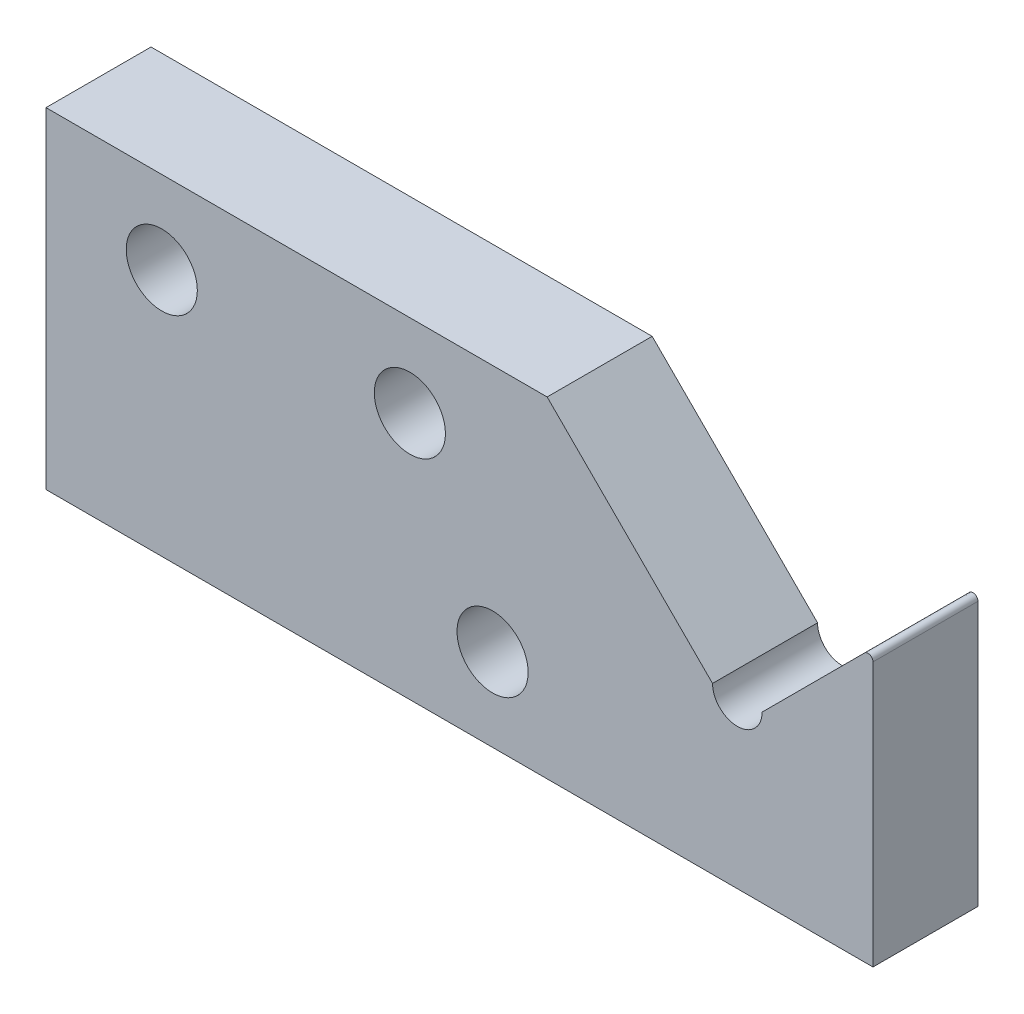
ISO-10303-21;
HEADER;
FILE_DESCRIPTION(('STEP AP214'),'2;1');
FILE_NAME('part.step','',(''),(''),'','','');
FILE_SCHEMA(('AUTOMOTIVE_DESIGN { 1 0 10303 214 1 1 1 1 }'));
ENDSEC;
DATA;
#1=APPLICATION_CONTEXT('core data for automotive mechanical design processes');
#2=APPLICATION_PROTOCOL_DEFINITION('international standard','automotive_design',2000,#1);
#3=PRODUCT_CONTEXT('',#1,'mechanical');
#4=PRODUCT('Part','Part','',(#3));
#5=PRODUCT_RELATED_PRODUCT_CATEGORY('part','',(#4));
#6=PRODUCT_DEFINITION_FORMATION('','',#4);
#7=PRODUCT_DEFINITION_CONTEXT('part definition',#1,'design');
#8=PRODUCT_DEFINITION('design','',#6,#7);
#9=PRODUCT_DEFINITION_SHAPE('','',#8);
#10=(LENGTH_UNIT() NAMED_UNIT(*) SI_UNIT(.MILLI.,.METRE.));
#11=(NAMED_UNIT(*) PLANE_ANGLE_UNIT() SI_UNIT($,.RADIAN.));
#12=(NAMED_UNIT(*) SI_UNIT($,.STERADIAN.) SOLID_ANGLE_UNIT());
#13=UNCERTAINTY_MEASURE_WITH_UNIT(LENGTH_MEASURE(1.E-05),#10,'distance_accuracy_value','');
#14=(GEOMETRIC_REPRESENTATION_CONTEXT(3) GLOBAL_UNCERTAINTY_ASSIGNED_CONTEXT((#13)) GLOBAL_UNIT_ASSIGNED_CONTEXT((#10,
#11,#12)) REPRESENTATION_CONTEXT('',''));
#15=CARTESIAN_POINT('',(0.,0.,0.));
#16=DIRECTION('',(0.,0.,1.));
#17=DIRECTION('',(1.,0.,0.));
#18=AXIS2_PLACEMENT_3D('',#15,#16,#17);
#19=CARTESIAN_POINT('',(-9.50000000000004,164.78629150102,-3.175));
#20=DIRECTION('',(1.,0.,0.));
#21=DIRECTION('',(0.,0.,-1.));
#22=AXIS2_PLACEMENT_3D('',#19,#20,#21);
#23=PLANE('',#22);
#24=DIRECTION('',(0.,1.,0.));
#25=VECTOR('',#24,1.);
#26=CARTESIAN_POINT('',(-9.50000000000004,164.78629150102,-3.175));
#27=LINE('',#26,#25);
#28=CARTESIAN_POINT('',(-9.50000000000004,164.78629150102,-3.175));
#29=VERTEX_POINT('',#28);
#30=CARTESIAN_POINT('',(-9.50000000000004,180.762027432302,-3.175));
#31=VERTEX_POINT('',#30);
#32=EDGE_CURVE('E138',#29,#31,#27,.T.);
#33=ORIENTED_EDGE('',*,*,#32,.T.);
#34=DIRECTION('',(0.,0.,1.));
#35=VECTOR('',#34,1.);
#36=CARTESIAN_POINT('',(-9.50000000000004,180.762027432302,-3.175));
#37=LINE('',#36,#35);
#38=CARTESIAN_POINT('',(-9.50000000000004,180.762027432302,3.175));
#39=VERTEX_POINT('',#38);
#40=EDGE_CURVE('E157',#31,#39,#37,.T.);
#41=ORIENTED_EDGE('',*,*,#40,.T.);
#42=DIRECTION('',(0.,1.,0.));
#43=VECTOR('',#42,1.);
#44=CARTESIAN_POINT('',(-9.50000000000004,164.78629150102,3.175));
#45=LINE('',#44,#43);
#46=CARTESIAN_POINT('',(-9.50000000000004,164.78629150102,3.175));
#47=VERTEX_POINT('',#46);
#48=EDGE_CURVE('E102',#47,#39,#45,.T.);
#49=ORIENTED_EDGE('',*,*,#48,.F.);
#50=DIRECTION('',(0.,0.,1.));
#51=VECTOR('',#50,1.);
#52=CARTESIAN_POINT('',(-9.50000000000004,164.78629150102,-3.175));
#53=LINE('',#52,#51);
#54=EDGE_CURVE('E155',#29,#47,#53,.T.);
#55=ORIENTED_EDGE('',*,*,#54,.F.);
#56=EDGE_LOOP('',(#33,#41,#49,#55));
#57=FACE_BOUND('',#56,.T.);
#58=ADVANCED_FACE('F33',(#57),#23,.T.);
#59=CARTESIAN_POINT('',(-9.50000000000004,164.78629150102,-3.175));
#60=DIRECTION('',(0.,-1.,0.));
#61=DIRECTION('',(1.,0.,0.));
#62=AXIS2_PLACEMENT_3D('',#59,#60,#61);
#63=PLANE('',#62);
#64=ORIENTED_EDGE('',*,*,#54,.T.);
#65=DIRECTION('',(1.,0.,0.));
#66=VECTOR('',#65,1.);
#67=CARTESIAN_POINT('',(-9.50000000000004,164.78629150102,3.175));
#68=LINE('',#67,#66);
#69=CARTESIAN_POINT('',(-59.5,164.786291501016,3.175));
#70=VERTEX_POINT('',#69);
#71=EDGE_CURVE('E126',#70,#47,#68,.T.);
#72=ORIENTED_EDGE('',*,*,#71,.F.);
#73=DIRECTION('',(0.,0.,1.));
#74=VECTOR('',#73,1.);
#75=CARTESIAN_POINT('',(-59.5,164.786291501016,-3.175));
#76=LINE('',#75,#74);
#77=CARTESIAN_POINT('',(-59.5,164.786291501016,-3.175));
#78=VERTEX_POINT('',#77);
#79=EDGE_CURVE('E158',#78,#70,#76,.T.);
#80=ORIENTED_EDGE('',*,*,#79,.F.);
#81=DIRECTION('',(1.,0.,0.));
#82=VECTOR('',#81,1.);
#83=CARTESIAN_POINT('',(-9.50000000000004,164.78629150102,-3.175));
#84=LINE('',#83,#82);
#85=EDGE_CURVE('E112',#78,#29,#84,.T.);
#86=ORIENTED_EDGE('',*,*,#85,.T.);
#87=EDGE_LOOP('',(#64,#72,#80,#86));
#88=FACE_BOUND('',#87,.T.);
#89=ADVANCED_FACE('F211',(#88),#63,.T.);
#90=CARTESIAN_POINT('',(-59.5,184.786291501016,-3.175));
#91=DIRECTION('',(-1.,0.,0.));
#92=DIRECTION('',(0.,0.,1.));
#93=AXIS2_PLACEMENT_3D('',#90,#91,#92);
#94=PLANE('',#93);
#95=CARTESIAN_POINT('',(-59.5,169.786291501016,0.));
#96=DIRECTION('',(-1.,0.,0.));
#97=DIRECTION('',(0.,0.,1.));
#98=AXIS2_PLACEMENT_3D('',#95,#96,#97);
#99=CIRCLE('',#98,1.6);
#100=CARTESIAN_POINT('',(-59.5,169.786291501016,1.6));
#101=VERTEX_POINT('',#100);
#102=EDGE_CURVE('E191',#101,#101,#99,.T.);
#103=ORIENTED_EDGE('',*,*,#102,.F.);
#104=EDGE_LOOP('',(#103));
#105=FACE_BOUND('',#104,.T.);
#106=ORIENTED_EDGE('',*,*,#79,.T.);
#107=DIRECTION('',(0.,-1.,0.));
#108=VECTOR('',#107,1.);
#109=CARTESIAN_POINT('',(-59.5,184.786291501016,3.175));
#110=LINE('',#109,#108);
#111=CARTESIAN_POINT('',(-59.5,184.786291501016,3.175));
#112=VERTEX_POINT('',#111);
#113=EDGE_CURVE('E123',#112,#70,#110,.T.);
#114=ORIENTED_EDGE('',*,*,#113,.F.);
#115=DIRECTION('',(0.,0.,1.));
#116=VECTOR('',#115,1.);
#117=CARTESIAN_POINT('',(-59.5,184.786291501016,-3.175));
#118=LINE('',#117,#116);
#119=CARTESIAN_POINT('',(-59.5,184.786291501016,-3.175));
#120=VERTEX_POINT('',#119);
#121=EDGE_CURVE('E160',#120,#112,#118,.T.);
#122=ORIENTED_EDGE('',*,*,#121,.F.);
#123=DIRECTION('',(0.,-1.,0.));
#124=VECTOR('',#123,1.);
#125=CARTESIAN_POINT('',(-59.5,184.786291501016,-3.175));
#126=LINE('',#125,#124);
#127=EDGE_CURVE('E150',#120,#78,#126,.T.);
#128=ORIENTED_EDGE('',*,*,#127,.T.);
#129=EDGE_LOOP('',(#106,#114,#122,#128));
#130=FACE_BOUND('',#129,.T.);
#131=ADVANCED_FACE('F207',(#105,#130),#94,.T.);
#132=CARTESIAN_POINT('',(-29.1999999999943,184.78629150102,-3.175));
#133=DIRECTION('',(-1.20915378919549E-13,1.,0.));
#134=DIRECTION('',(-1.,-1.20915378919549E-13,0.));
#135=AXIS2_PLACEMENT_3D('',#132,#133,#134);
#136=PLANE('',#135);
#137=ORIENTED_EDGE('',*,*,#121,.T.);
#138=DIRECTION('',(-1.,-1.20915378919549E-13,0.));
#139=VECTOR('',#138,1.);
#140=CARTESIAN_POINT('',(-29.1999999999943,184.78629150102,3.175));
#141=LINE('',#140,#139);
#142=CARTESIAN_POINT('',(-29.1999999999943,184.78629150102,3.175));
#143=VERTEX_POINT('',#142);
#144=EDGE_CURVE('E117',#143,#112,#141,.T.);
#145=ORIENTED_EDGE('',*,*,#144,.F.);
#146=DIRECTION('',(0.,0.,1.));
#147=VECTOR('',#146,1.);
#148=CARTESIAN_POINT('',(-29.1999999999943,184.78629150102,-3.175));
#149=LINE('',#148,#147);
#150=CARTESIAN_POINT('',(-29.1999999999943,184.78629150102,-3.175));
#151=VERTEX_POINT('',#150);
#152=EDGE_CURVE('E162',#151,#143,#149,.T.);
#153=ORIENTED_EDGE('',*,*,#152,.F.);
#154=DIRECTION('',(-1.,-1.20915378919549E-13,0.));
#155=VECTOR('',#154,1.);
#156=CARTESIAN_POINT('',(-29.1999999999943,184.78629150102,-3.175));
#157=LINE('',#156,#155);
#158=EDGE_CURVE('E147',#151,#120,#157,.T.);
#159=ORIENTED_EDGE('',*,*,#158,.T.);
#160=EDGE_LOOP('',(#137,#145,#153,#159));
#161=FACE_BOUND('',#160,.T.);
#162=ADVANCED_FACE('F210',(#161),#136,.T.);
#163=CARTESIAN_POINT('',(-19.1999999999969,174.786291501019,-3.175));
#164=DIRECTION('',(0.707106781186657,0.707106781186438,0.));
#165=DIRECTION('',(-0.707106781186438,0.707106781186657,0.));
#166=AXIS2_PLACEMENT_3D('',#163,#164,#165);
#167=PLANE('',#166);
#168=ORIENTED_EDGE('',*,*,#152,.T.);
#169=DIRECTION('',(-0.707106781186438,0.707106781186657,0.));
#170=VECTOR('',#169,1.);
#171=CARTESIAN_POINT('',(-19.1999999999969,174.786291501019,3.175));
#172=LINE('',#171,#170);
#173=CARTESIAN_POINT('',(-19.1999999999969,174.786291501019,3.175));
#174=VERTEX_POINT('',#173);
#175=EDGE_CURVE('E115',#174,#143,#172,.T.);
#176=ORIENTED_EDGE('',*,*,#175,.F.);
#177=DIRECTION('',(0.,0.,1.));
#178=VECTOR('',#177,1.);
#179=CARTESIAN_POINT('',(-19.1999999999969,174.786291501019,-3.175));
#180=LINE('',#179,#178);
#181=CARTESIAN_POINT('',(-19.1999999999969,174.786291501019,-3.175));
#182=VERTEX_POINT('',#181);
#183=EDGE_CURVE('E111',#182,#174,#180,.T.);
#184=ORIENTED_EDGE('',*,*,#183,.F.);
#185=DIRECTION('',(-0.707106781186438,0.707106781186657,0.));
#186=VECTOR('',#185,1.);
#187=CARTESIAN_POINT('',(-19.1999999999969,174.786291501019,-3.175));
#188=LINE('',#187,#186);
#189=EDGE_CURVE('E144',#182,#151,#188,.T.);
#190=ORIENTED_EDGE('',*,*,#189,.T.);
#191=EDGE_LOOP('',(#168,#176,#184,#190));
#192=FACE_BOUND('',#191,.T.);
#193=ADVANCED_FACE('F238',(#192),#167,.T.);
#194=CARTESIAN_POINT('',(-17.6999999999969,174.786291501019,-3.175));
#195=DIRECTION('',(0.,0.,1.));
#196=DIRECTION('',(1.,0.,0.));
#197=AXIS2_PLACEMENT_3D('',#194,#195,#196);
#198=CYLINDRICAL_SURFACE('',#197,1.5);
#199=ORIENTED_EDGE('',*,*,#183,.T.);
#200=CARTESIAN_POINT('',(-17.6999999999969,174.786291501019,3.175));
#201=DIRECTION('',(0.,0.,-1.));
#202=DIRECTION('',(1.,0.,0.));
#203=AXIS2_PLACEMENT_3D('',#200,#201,#202);
#204=CIRCLE('',#203,1.5);
#205=CARTESIAN_POINT('',(-16.1999999999969,174.786291501019,3.175));
#206=VERTEX_POINT('',#205);
#207=EDGE_CURVE('E100',#206,#174,#204,.T.);
#208=ORIENTED_EDGE('',*,*,#207,.F.);
#209=DIRECTION('',(0.,0.,1.));
#210=VECTOR('',#209,1.);
#211=CARTESIAN_POINT('',(-16.1999999999969,174.786291501019,-3.175));
#212=LINE('',#211,#210);
#213=CARTESIAN_POINT('',(-16.1999999999969,174.786291501019,-3.175));
#214=VERTEX_POINT('',#213);
#215=EDGE_CURVE('E105',#214,#206,#212,.T.);
#216=ORIENTED_EDGE('',*,*,#215,.F.);
#217=CARTESIAN_POINT('',(-17.6999999999969,174.786291501019,-3.175));
#218=DIRECTION('',(0.,0.,-1.));
#219=DIRECTION('',(1.,0.,0.));
#220=AXIS2_PLACEMENT_3D('',#217,#218,#219);
#221=CIRCLE('',#220,1.5);
#222=EDGE_CURVE('E142',#214,#182,#221,.T.);
#223=ORIENTED_EDGE('',*,*,#222,.T.);
#224=EDGE_LOOP('',(#199,#208,#216,#223));
#225=FACE_BOUND('',#224,.T.);
#226=ADVANCED_FACE('F114',(#225),#198,.F.);
#227=CARTESIAN_POINT('',(-9.50000000000004,181.486291501014,-3.175));
#228=DIRECTION('',(-0.707106781186438,0.707106781186657,0.));
#229=DIRECTION('',(-0.707106781186657,-0.707106781186438,0.));
#230=AXIS2_PLACEMENT_3D('',#227,#228,#229);
#231=PLANE('',#230);
#232=DIRECTION('',(-0.707106781186657,-0.707106781186438,0.));
#233=VECTOR('',#232,1.);
#234=CARTESIAN_POINT('',(-9.50000000000004,181.486291501014,3.175));
#235=LINE('',#234,#233);
#236=CARTESIAN_POINT('',(-10.012132034356,180.974159466658,3.175));
#237=VERTEX_POINT('',#236);
#238=EDGE_CURVE('E94',#237,#206,#235,.T.);
#239=ORIENTED_EDGE('',*,*,#238,.F.);
#240=DIRECTION('',(0.,0.,1.));
#241=VECTOR('',#240,1.);
#242=CARTESIAN_POINT('',(-10.012132034356,180.974159466658,-3.175));
#243=LINE('',#242,#241);
#244=CARTESIAN_POINT('',(-10.012132034356,180.974159466658,-3.175));
#245=VERTEX_POINT('',#244);
#246=EDGE_CURVE('E41',#237,#245,#243,.F.);
#247=ORIENTED_EDGE('',*,*,#246,.T.);
#248=DIRECTION('',(-0.707106781186657,-0.707106781186438,0.));
#249=VECTOR('',#248,1.);
#250=CARTESIAN_POINT('',(-9.50000000000004,181.486291501014,-3.175));
#251=LINE('',#250,#249);
#252=EDGE_CURVE('E107',#245,#214,#251,.T.);
#253=ORIENTED_EDGE('',*,*,#252,.T.);
#254=ORIENTED_EDGE('',*,*,#215,.T.);
#255=EDGE_LOOP('',(#239,#247,#253,#254));
#256=FACE_BOUND('',#255,.T.);
#257=ADVANCED_FACE('F106',(#256),#231,.T.);
#258=CARTESIAN_POINT('',(-17.6999999999969,174.786291501019,-3.175));
#259=DIRECTION('',(0.,0.,1.));
#260=DIRECTION('',(1.,0.,0.));
#261=AXIS2_PLACEMENT_3D('',#258,#259,#260);
#262=PLANE('',#261);
#263=CARTESIAN_POINT('',(-32.5,169.786291501016,-3.175));
#264=DIRECTION('',(0.,0.,1.));
#265=DIRECTION('',(1.,0.,0.));
#266=AXIS2_PLACEMENT_3D('',#263,#264,#265);
#267=CIRCLE('',#266,2.15000000000002);
#268=CARTESIAN_POINT('',(-30.35,169.786291501016,-3.175));
#269=VERTEX_POINT('',#268);
#270=EDGE_CURVE('E129',#269,#269,#267,.T.);
#271=ORIENTED_EDGE('',*,*,#270,.T.);
#272=EDGE_LOOP('',(#271));
#273=FACE_BOUND('',#272,.T.);
#274=CARTESIAN_POINT('',(-37.5,179.786291501017,-3.175));
#275=DIRECTION('',(0.,0.,1.));
#276=DIRECTION('',(1.,0.,0.));
#277=AXIS2_PLACEMENT_3D('',#274,#275,#276);
#278=CIRCLE('',#277,2.14999999999987);
#279=CARTESIAN_POINT('',(-35.3500000000002,179.786291501017,-3.175));
#280=VERTEX_POINT('',#279);
#281=EDGE_CURVE('E132',#280,#280,#278,.T.);
#282=ORIENTED_EDGE('',*,*,#281,.T.);
#283=EDGE_LOOP('',(#282));
#284=FACE_BOUND('',#283,.T.);
#285=CARTESIAN_POINT('',(-52.5,179.786291501016,-3.175));
#286=DIRECTION('',(0.,0.,1.));
#287=DIRECTION('',(1.,0.,0.));
#288=AXIS2_PLACEMENT_3D('',#285,#286,#287);
#289=CIRCLE('',#288,2.15000000000003);
#290=CARTESIAN_POINT('',(-50.35,179.786291501016,-3.175));
#291=VERTEX_POINT('',#290);
#292=EDGE_CURVE('E135',#291,#291,#289,.T.);
#293=ORIENTED_EDGE('',*,*,#292,.T.);
#294=EDGE_LOOP('',(#293));
#295=FACE_BOUND('',#294,.T.);
#296=ORIENTED_EDGE('',*,*,#252,.F.);
#297=CARTESIAN_POINT('',(-9.80000000000004,180.762027432302,-3.175));
#298=DIRECTION('',(0.,0.,1.));
#299=DIRECTION('',(1.,0.,0.));
#300=AXIS2_PLACEMENT_3D('',#297,#298,#299);
#301=CIRCLE('',#300,0.3);
#302=EDGE_CURVE('E12',#245,#31,#301,.F.);
#303=ORIENTED_EDGE('',*,*,#302,.T.);
#304=ORIENTED_EDGE('',*,*,#32,.F.);
#305=ORIENTED_EDGE('',*,*,#85,.F.);
#306=ORIENTED_EDGE('',*,*,#127,.F.);
#307=ORIENTED_EDGE('',*,*,#158,.F.);
#308=ORIENTED_EDGE('',*,*,#189,.F.);
#309=ORIENTED_EDGE('',*,*,#222,.F.);
#310=EDGE_LOOP('',(#296,#303,#304,#305,#306,#307,#308,#309));
#311=FACE_BOUND('',#310,.T.);
#312=ADVANCED_FACE('F219',(#273,#284,#295,#311),#262,.F.);
#313=CARTESIAN_POINT('',(-52.5,179.786291501016,-3.175));
#314=DIRECTION('',(0.,0.,1.));
#315=DIRECTION('',(1.,0.,0.));
#316=AXIS2_PLACEMENT_3D('',#313,#314,#315);
#317=CYLINDRICAL_SURFACE('',#316,2.15000000000003);
#318=ORIENTED_EDGE('',*,*,#292,.F.);
#319=EDGE_LOOP('',(#318));
#320=FACE_BOUND('',#319,.T.);
#321=CARTESIAN_POINT('',(-52.5,179.786291501016,3.175));
#322=DIRECTION('',(0.,0.,1.));
#323=DIRECTION('',(1.,0.,0.));
#324=AXIS2_PLACEMENT_3D('',#321,#322,#323);
#325=CIRCLE('',#324,2.15000000000003);
#326=CARTESIAN_POINT('',(-50.35,179.786291501016,3.175));
#327=VERTEX_POINT('',#326);
#328=EDGE_CURVE('E179',#327,#327,#325,.T.);
#329=ORIENTED_EDGE('',*,*,#328,.T.);
#330=EDGE_LOOP('',(#329));
#331=FACE_BOUND('',#330,.T.);
#332=ADVANCED_FACE('F247',(#320,#331),#317,.F.);
#333=CARTESIAN_POINT('',(-37.5,179.786291501017,-3.175));
#334=DIRECTION('',(0.,0.,1.));
#335=DIRECTION('',(1.,0.,0.));
#336=AXIS2_PLACEMENT_3D('',#333,#334,#335);
#337=CYLINDRICAL_SURFACE('',#336,2.14999999999987);
#338=ORIENTED_EDGE('',*,*,#281,.F.);
#339=EDGE_LOOP('',(#338));
#340=FACE_BOUND('',#339,.T.);
#341=CARTESIAN_POINT('',(-37.5,179.786291501017,3.175));
#342=DIRECTION('',(0.,0.,1.));
#343=DIRECTION('',(1.,0.,0.));
#344=AXIS2_PLACEMENT_3D('',#341,#342,#343);
#345=CIRCLE('',#344,2.14999999999987);
#346=CARTESIAN_POINT('',(-35.3500000000002,179.786291501017,3.175));
#347=VERTEX_POINT('',#346);
#348=EDGE_CURVE('E181',#347,#347,#345,.T.);
#349=ORIENTED_EDGE('',*,*,#348,.T.);
#350=EDGE_LOOP('',(#349));
#351=FACE_BOUND('',#350,.T.);
#352=ADVANCED_FACE('F251',(#340,#351),#337,.F.);
#353=CARTESIAN_POINT('',(-32.5,169.786291501016,-3.175));
#354=DIRECTION('',(0.,0.,1.));
#355=DIRECTION('',(1.,0.,0.));
#356=AXIS2_PLACEMENT_3D('',#353,#354,#355);
#357=CYLINDRICAL_SURFACE('',#356,2.15000000000002);
#358=ORIENTED_EDGE('',*,*,#270,.F.);
#359=EDGE_LOOP('',(#358));
#360=FACE_BOUND('',#359,.T.);
#361=CARTESIAN_POINT('',(-32.5,169.786291501016,3.175));
#362=DIRECTION('',(0.,0.,1.));
#363=DIRECTION('',(1.,0.,0.));
#364=AXIS2_PLACEMENT_3D('',#361,#362,#363);
#365=CIRCLE('',#364,2.15000000000002);
#366=CARTESIAN_POINT('',(-30.35,169.786291501016,3.175));
#367=VERTEX_POINT('',#366);
#368=EDGE_CURVE('E186',#367,#367,#365,.T.);
#369=ORIENTED_EDGE('',*,*,#368,.T.);
#370=EDGE_LOOP('',(#369));
#371=FACE_BOUND('',#370,.T.);
#372=ADVANCED_FACE('F255',(#360,#371),#357,.F.);
#373=CARTESIAN_POINT('',(-17.6999999999969,174.786291501019,3.175));
#374=DIRECTION('',(0.,0.,1.));
#375=DIRECTION('',(1.,0.,0.));
#376=AXIS2_PLACEMENT_3D('',#373,#374,#375);
#377=PLANE('',#376);
#378=ORIENTED_EDGE('',*,*,#348,.F.);
#379=EDGE_LOOP('',(#378));
#380=FACE_BOUND('',#379,.T.);
#381=ORIENTED_EDGE('',*,*,#48,.T.);
#382=CARTESIAN_POINT('',(-9.80000000000004,180.762027432302,3.175));
#383=DIRECTION('',(0.,0.,1.));
#384=DIRECTION('',(1.,0.,0.));
#385=AXIS2_PLACEMENT_3D('',#382,#383,#384);
#386=CIRCLE('',#385,0.3);
#387=EDGE_CURVE('E55',#39,#237,#386,.T.);
#388=ORIENTED_EDGE('',*,*,#387,.T.);
#389=ORIENTED_EDGE('',*,*,#238,.T.);
#390=ORIENTED_EDGE('',*,*,#207,.T.);
#391=ORIENTED_EDGE('',*,*,#175,.T.);
#392=ORIENTED_EDGE('',*,*,#144,.T.);
#393=ORIENTED_EDGE('',*,*,#113,.T.);
#394=ORIENTED_EDGE('',*,*,#71,.T.);
#395=EDGE_LOOP('',(#381,#388,#389,#390,#391,#392,#393,#394));
#396=FACE_BOUND('',#395,.T.);
#397=ORIENTED_EDGE('',*,*,#328,.F.);
#398=EDGE_LOOP('',(#397));
#399=FACE_BOUND('',#398,.T.);
#400=ORIENTED_EDGE('',*,*,#368,.F.);
#401=EDGE_LOOP('',(#400));
#402=FACE_BOUND('',#401,.T.);
#403=ADVANCED_FACE('F96',(#380,#396,#399,#402),#377,.T.);
#404=CARTESIAN_POINT('',(-54.5,169.786291501016,0.));
#405=DIRECTION('',(-1.,0.,0.));
#406=DIRECTION('',(0.,0.,1.));
#407=AXIS2_PLACEMENT_3D('',#404,#405,#406);
#408=PLANE('',#407);
#409=CARTESIAN_POINT('',(-54.5,169.786291501016,0.));
#410=DIRECTION('',(-1.,0.,0.));
#411=DIRECTION('',(0.,0.,1.));
#412=AXIS2_PLACEMENT_3D('',#409,#410,#411);
#413=CIRCLE('',#412,1.6);
#414=CARTESIAN_POINT('',(-54.5,169.786291501016,1.6));
#415=VERTEX_POINT('',#414);
#416=EDGE_CURVE('E169',#415,#415,#413,.T.);
#417=ORIENTED_EDGE('',*,*,#416,.T.);
#418=EDGE_LOOP('',(#417));
#419=FACE_BOUND('',#418,.T.);
#420=CARTESIAN_POINT('',(-54.5,169.786291501016,0.));
#421=DIRECTION('',(-1.,0.,0.));
#422=DIRECTION('',(0.,0.,1.));
#423=AXIS2_PLACEMENT_3D('',#420,#421,#422);
#424=CIRCLE('',#423,1.34999999999999);
#425=CARTESIAN_POINT('',(-54.5,169.786291501016,1.34999999999999));
#426=VERTEX_POINT('',#425);
#427=EDGE_CURVE('E165',#426,#426,#424,.F.);
#428=ORIENTED_EDGE('',*,*,#427,.T.);
#429=EDGE_LOOP('',(#428));
#430=FACE_BOUND('',#429,.T.);
#431=ADVANCED_FACE('F197',(#419,#430),#408,.T.);
#432=CARTESIAN_POINT('',(-54.5,169.786291501016,0.));
#433=DIRECTION('',(-1.,0.,0.));
#434=DIRECTION('',(0.,0.,1.));
#435=AXIS2_PLACEMENT_3D('',#432,#433,#434);
#436=CYLINDRICAL_SURFACE('',#435,1.6);
#437=ORIENTED_EDGE('',*,*,#416,.F.);
#438=EDGE_LOOP('',(#437));
#439=FACE_BOUND('',#438,.T.);
#440=ORIENTED_EDGE('',*,*,#102,.T.);
#441=EDGE_LOOP('',(#440));
#442=FACE_BOUND('',#441,.T.);
#443=ADVANCED_FACE('F200',(#439,#442),#436,.F.);
#444=CARTESIAN_POINT('',(-38.6339745962156,169.786291501016,0.));
#445=DIRECTION('',(-1.,0.,0.));
#446=DIRECTION('',(0.,0.,1.));
#447=AXIS2_PLACEMENT_3D('',#444,#445,#446);
#448=PLANE('',#447);
#449=CARTESIAN_POINT('',(-38.6339745962156,169.786291501016,0.));
#450=DIRECTION('',(-1.,0.,0.));
#451=DIRECTION('',(0.,0.,1.));
#452=AXIS2_PLACEMENT_3D('',#449,#450,#451);
#453=CIRCLE('',#452,1.34999999999999);
#454=CARTESIAN_POINT('',(-38.6339745962156,169.786291501016,1.34999999999999));
#455=VERTEX_POINT('',#454);
#456=EDGE_CURVE('E168',#455,#455,#453,.T.);
#457=ORIENTED_EDGE('',*,*,#456,.T.);
#458=EDGE_LOOP('',(#457));
#459=FACE_BOUND('',#458,.T.);
#460=ADVANCED_FACE('F203',(#459),#448,.T.);
#461=CARTESIAN_POINT('',(-38.6339745962156,169.786291501016,0.));
#462=DIRECTION('',(-1.,0.,0.));
#463=DIRECTION('',(0.,0.,1.));
#464=AXIS2_PLACEMENT_3D('',#461,#462,#463);
#465=CYLINDRICAL_SURFACE('',#464,1.34999999999999);
#466=ORIENTED_EDGE('',*,*,#456,.F.);
#467=EDGE_LOOP('',(#466));
#468=FACE_BOUND('',#467,.T.);
#469=ORIENTED_EDGE('',*,*,#427,.F.);
#470=EDGE_LOOP('',(#469));
#471=FACE_BOUND('',#470,.T.);
#472=ADVANCED_FACE('F221',(#468,#471),#465,.F.);
#473=CARTESIAN_POINT('',(-9.80000000000004,180.762027432302,-3.175));
#474=DIRECTION('',(0.,0.,1.));
#475=DIRECTION('',(1.,0.,0.));
#476=AXIS2_PLACEMENT_3D('',#473,#474,#475);
#477=CYLINDRICAL_SURFACE('',#476,0.3);
#478=ORIENTED_EDGE('',*,*,#302,.F.);
#479=ORIENTED_EDGE('',*,*,#246,.F.);
#480=ORIENTED_EDGE('',*,*,#387,.F.);
#481=ORIENTED_EDGE('',*,*,#40,.F.);
#482=EDGE_LOOP('',(#478,#479,#480,#481));
#483=FACE_BOUND('',#482,.T.);
#484=ADVANCED_FACE('F35',(#483),#477,.T.);
#485=CLOSED_SHELL('',(#58,#89,#131,#162,#193,#226,#257,#312,#332,#352,#372,#403,#431,#443,#460,
#472,#484));
#486=MANIFOLD_SOLID_BREP('B2',#485);
#487=ADVANCED_BREP_SHAPE_REPRESENTATION('',(#18,#486),#14);
#488=SHAPE_DEFINITION_REPRESENTATION(#9,#487);
ENDSEC;
END-ISO-10303-21;
